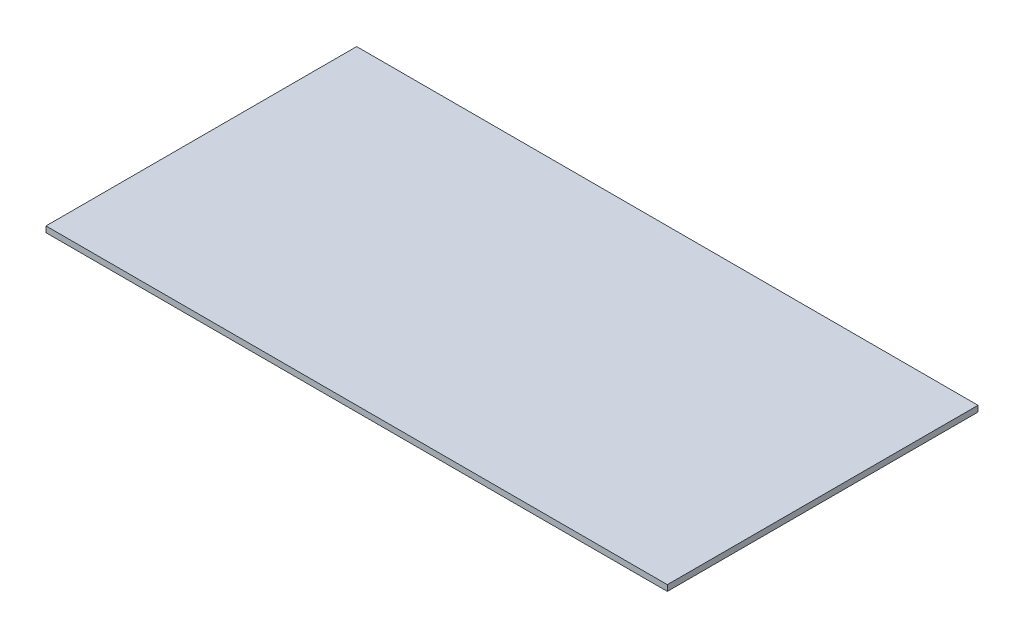
ISO-10303-21;
HEADER;
FILE_DESCRIPTION(('STEP AP214'),'2;1');
FILE_NAME('part.step','',(''),(''),'','','');
FILE_SCHEMA(('AUTOMOTIVE_DESIGN { 1 0 10303 214 1 1 1 1 }'));
ENDSEC;
DATA;
#1=APPLICATION_CONTEXT('core data for automotive mechanical design processes');
#2=APPLICATION_PROTOCOL_DEFINITION('international standard','automotive_design',2000,#1);
#3=PRODUCT_CONTEXT('',#1,'mechanical');
#4=PRODUCT('Part','Part','',(#3));
#5=PRODUCT_RELATED_PRODUCT_CATEGORY('part','',(#4));
#6=PRODUCT_DEFINITION_FORMATION('','',#4);
#7=PRODUCT_DEFINITION_CONTEXT('part definition',#1,'design');
#8=PRODUCT_DEFINITION('design','',#6,#7);
#9=PRODUCT_DEFINITION_SHAPE('','',#8);
#10=(LENGTH_UNIT() NAMED_UNIT(*) SI_UNIT(.MILLI.,.METRE.));
#11=(NAMED_UNIT(*) PLANE_ANGLE_UNIT() SI_UNIT($,.RADIAN.));
#12=(NAMED_UNIT(*) SI_UNIT($,.STERADIAN.) SOLID_ANGLE_UNIT());
#13=UNCERTAINTY_MEASURE_WITH_UNIT(LENGTH_MEASURE(1.E-05),#10,'distance_accuracy_value','');
#14=(GEOMETRIC_REPRESENTATION_CONTEXT(3) GLOBAL_UNCERTAINTY_ASSIGNED_CONTEXT((#13)) GLOBAL_UNIT_ASSIGNED_CONTEXT((#10,
#11,#12)) REPRESENTATION_CONTEXT('',''));
#15=CARTESIAN_POINT('',(0.,0.,0.));
#16=DIRECTION('',(0.,0.,1.));
#17=DIRECTION('',(1.,0.,0.));
#18=AXIS2_PLACEMENT_3D('',#15,#16,#17);
#19=CARTESIAN_POINT('',(0.,4.7625,0.));
#20=DIRECTION('',(1.,0.,0.));
#21=DIRECTION('',(0.,0.,-1.));
#22=AXIS2_PLACEMENT_3D('',#19,#20,#21);
#23=PLANE('',#22);
#24=DIRECTION('',(0.,0.,1.));
#25=VECTOR('',#24,1.);
#26=CARTESIAN_POINT('',(0.,0.,0.));
#27=LINE('',#26,#25);
#28=CARTESIAN_POINT('',(0.,0.,0.));
#29=VERTEX_POINT('',#28);
#30=CARTESIAN_POINT('',(1.15928056980147E-13,0.,250.825));
#31=VERTEX_POINT('',#30);
#32=EDGE_CURVE('E96',#29,#31,#27,.T.);
#33=ORIENTED_EDGE('',*,*,#32,.T.);
#34=DIRECTION('',(0.,-1.,0.));
#35=VECTOR('',#34,1.);
#36=CARTESIAN_POINT('',(1.15928056980147E-13,4.7625,250.825));
#37=LINE('',#36,#35);
#38=CARTESIAN_POINT('',(1.15928056980147E-13,4.7625,250.825));
#39=VERTEX_POINT('',#38);
#40=EDGE_CURVE('E11',#39,#31,#37,.T.);
#41=ORIENTED_EDGE('',*,*,#40,.F.);
#42=DIRECTION('',(0.,0.,1.));
#43=VECTOR('',#42,1.);
#44=CARTESIAN_POINT('',(0.,4.7625,0.));
#45=LINE('',#44,#43);
#46=CARTESIAN_POINT('',(0.,4.7625,0.));
#47=VERTEX_POINT('',#46);
#48=EDGE_CURVE('E82',#47,#39,#45,.T.);
#49=ORIENTED_EDGE('',*,*,#48,.F.);
#50=DIRECTION('',(0.,-1.,0.));
#51=VECTOR('',#50,1.);
#52=CARTESIAN_POINT('',(0.,4.7625,0.));
#53=LINE('',#52,#51);
#54=EDGE_CURVE('E49',#47,#29,#53,.T.);
#55=ORIENTED_EDGE('',*,*,#54,.T.);
#56=EDGE_LOOP('',(#33,#41,#49,#55));
#57=FACE_BOUND('',#56,.T.);
#58=ADVANCED_FACE('F33',(#57),#23,.F.);
#59=CARTESIAN_POINT('',(1.15928056980147E-13,4.7625,250.825));
#60=DIRECTION('',(0.,0.,-1.));
#61=DIRECTION('',(-1.,0.,0.));
#62=AXIS2_PLACEMENT_3D('',#59,#60,#61);
#63=PLANE('',#62);
#64=DIRECTION('',(1.,0.,0.));
#65=VECTOR('',#64,1.);
#66=CARTESIAN_POINT('',(1.15928056980147E-13,0.,250.825));
#67=LINE('',#66,#65);
#68=CARTESIAN_POINT('',(501.65,0.,250.825));
#69=VERTEX_POINT('',#68);
#70=EDGE_CURVE('E87',#31,#69,#67,.T.);
#71=ORIENTED_EDGE('',*,*,#70,.T.);
#72=DIRECTION('',(0.,-1.,0.));
#73=VECTOR('',#72,1.);
#74=CARTESIAN_POINT('',(501.65,4.7625,250.825));
#75=LINE('',#74,#73);
#76=CARTESIAN_POINT('',(501.65,4.7625,250.825));
#77=VERTEX_POINT('',#76);
#78=EDGE_CURVE('E41',#77,#69,#75,.T.);
#79=ORIENTED_EDGE('',*,*,#78,.F.);
#80=DIRECTION('',(1.,0.,0.));
#81=VECTOR('',#80,1.);
#82=CARTESIAN_POINT('',(1.15928056980147E-13,4.7625,250.825));
#83=LINE('',#82,#81);
#84=EDGE_CURVE('E74',#39,#77,#83,.T.);
#85=ORIENTED_EDGE('',*,*,#84,.F.);
#86=ORIENTED_EDGE('',*,*,#40,.T.);
#87=EDGE_LOOP('',(#71,#79,#85,#86));
#88=FACE_BOUND('',#87,.T.);
#89=ADVANCED_FACE('F86',(#88),#63,.F.);
#90=CARTESIAN_POINT('',(501.65,4.7625,0.));
#91=DIRECTION('',(1.,0.,0.));
#92=DIRECTION('',(0.,0.,-1.));
#93=AXIS2_PLACEMENT_3D('',#90,#91,#92);
#94=PLANE('',#93);
#95=DIRECTION('',(0.,0.,1.));
#96=VECTOR('',#95,1.);
#97=CARTESIAN_POINT('',(501.65,0.,0.));
#98=LINE('',#97,#96);
#99=CARTESIAN_POINT('',(501.65,0.,0.));
#100=VERTEX_POINT('',#99);
#101=EDGE_CURVE('E99',#100,#69,#98,.T.);
#102=ORIENTED_EDGE('',*,*,#101,.F.);
#103=DIRECTION('',(0.,-1.,0.));
#104=VECTOR('',#103,1.);
#105=CARTESIAN_POINT('',(501.65,4.7625,0.));
#106=LINE('',#105,#104);
#107=CARTESIAN_POINT('',(501.65,4.7625,0.));
#108=VERTEX_POINT('',#107);
#109=EDGE_CURVE('E63',#108,#100,#106,.T.);
#110=ORIENTED_EDGE('',*,*,#109,.F.);
#111=DIRECTION('',(0.,0.,1.));
#112=VECTOR('',#111,1.);
#113=CARTESIAN_POINT('',(501.65,4.7625,0.));
#114=LINE('',#113,#112);
#115=EDGE_CURVE('E81',#108,#77,#114,.T.);
#116=ORIENTED_EDGE('',*,*,#115,.T.);
#117=ORIENTED_EDGE('',*,*,#78,.T.);
#118=EDGE_LOOP('',(#102,#110,#116,#117));
#119=FACE_BOUND('',#118,.T.);
#120=ADVANCED_FACE('F90',(#119),#94,.T.);
#121=CARTESIAN_POINT('',(0.,4.7625,0.));
#122=DIRECTION('',(0.,0.,-1.));
#123=DIRECTION('',(-1.,0.,0.));
#124=AXIS2_PLACEMENT_3D('',#121,#122,#123);
#125=PLANE('',#124);
#126=DIRECTION('',(1.,0.,0.));
#127=VECTOR('',#126,1.);
#128=CARTESIAN_POINT('',(0.,0.,0.));
#129=LINE('',#128,#127);
#130=EDGE_CURVE('E101',#29,#100,#129,.T.);
#131=ORIENTED_EDGE('',*,*,#130,.F.);
#132=ORIENTED_EDGE('',*,*,#54,.F.);
#133=DIRECTION('',(1.,0.,0.));
#134=VECTOR('',#133,1.);
#135=CARTESIAN_POINT('',(0.,4.7625,0.));
#136=LINE('',#135,#134);
#137=EDGE_CURVE('E91',#47,#108,#136,.T.);
#138=ORIENTED_EDGE('',*,*,#137,.T.);
#139=ORIENTED_EDGE('',*,*,#109,.T.);
#140=EDGE_LOOP('',(#131,#132,#138,#139));
#141=FACE_BOUND('',#140,.T.);
#142=ADVANCED_FACE('F107',(#141),#125,.T.);
#143=CARTESIAN_POINT('',(0.,4.7625,0.));
#144=DIRECTION('',(0.,1.,0.));
#145=DIRECTION('',(0.,0.,1.));
#146=AXIS2_PLACEMENT_3D('',#143,#144,#145);
#147=PLANE('',#146);
#148=ORIENTED_EDGE('',*,*,#48,.T.);
#149=ORIENTED_EDGE('',*,*,#84,.T.);
#150=ORIENTED_EDGE('',*,*,#115,.F.);
#151=ORIENTED_EDGE('',*,*,#137,.F.);
#152=EDGE_LOOP('',(#148,#149,#150,#151));
#153=FACE_BOUND('',#152,.T.);
#154=ADVANCED_FACE('F78',(#153),#147,.T.);
#155=CARTESIAN_POINT('',(0.,0.,0.));
#156=DIRECTION('',(0.,1.,0.));
#157=DIRECTION('',(0.,0.,1.));
#158=AXIS2_PLACEMENT_3D('',#155,#156,#157);
#159=PLANE('',#158);
#160=ORIENTED_EDGE('',*,*,#32,.F.);
#161=ORIENTED_EDGE('',*,*,#130,.T.);
#162=ORIENTED_EDGE('',*,*,#101,.T.);
#163=ORIENTED_EDGE('',*,*,#70,.F.);
#164=EDGE_LOOP('',(#160,#161,#162,#163));
#165=FACE_BOUND('',#164,.T.);
#166=ADVANCED_FACE('F106',(#165),#159,.F.);
#167=CLOSED_SHELL('',(#58,#89,#120,#142,#154,#166));
#168=MANIFOLD_SOLID_BREP('B2',#167);
#169=ADVANCED_BREP_SHAPE_REPRESENTATION('',(#18,#168),#14);
#170=SHAPE_DEFINITION_REPRESENTATION(#9,#169);
ENDSEC;
END-ISO-10303-21;
